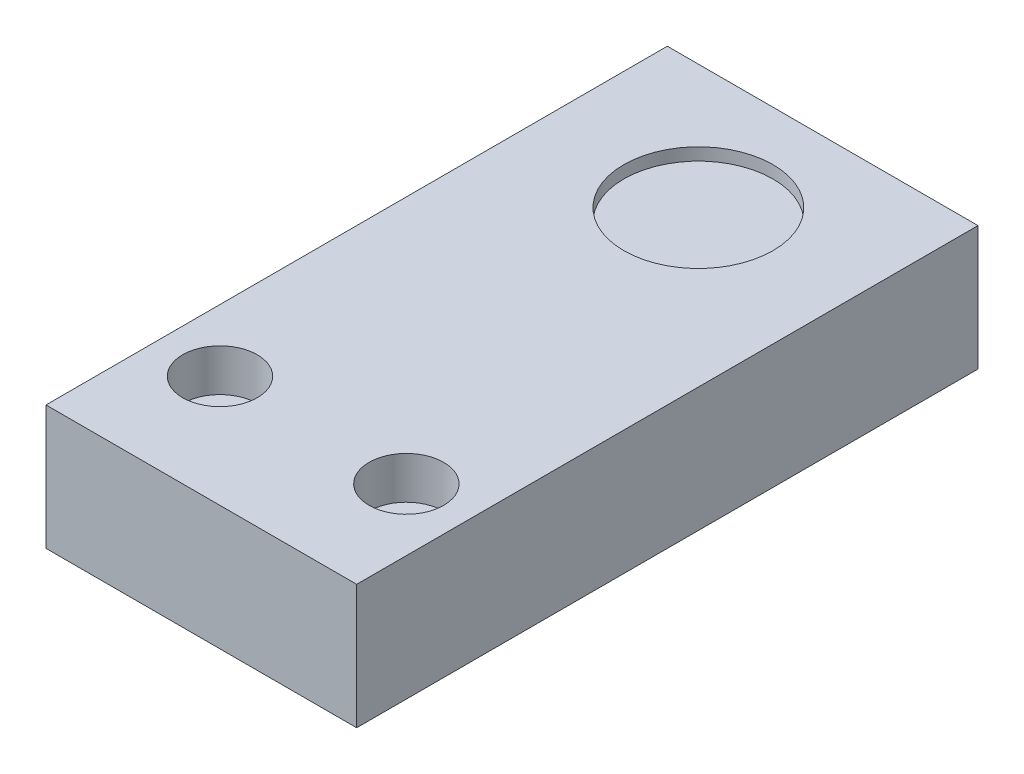
ISO-10303-21;
HEADER;
FILE_DESCRIPTION(('STEP AP214'),'2;1');
FILE_NAME('part.step','',(''),(''),'','','');
FILE_SCHEMA(('AUTOMOTIVE_DESIGN { 1 0 10303 214 1 1 1 1 }'));
ENDSEC;
DATA;
#1=APPLICATION_CONTEXT('core data for automotive mechanical design processes');
#2=APPLICATION_PROTOCOL_DEFINITION('international standard','automotive_design',2000,#1);
#3=PRODUCT_CONTEXT('',#1,'mechanical');
#4=PRODUCT('Part','Part','',(#3));
#5=PRODUCT_RELATED_PRODUCT_CATEGORY('part','',(#4));
#6=PRODUCT_DEFINITION_FORMATION('','',#4);
#7=PRODUCT_DEFINITION_CONTEXT('part definition',#1,'design');
#8=PRODUCT_DEFINITION('design','',#6,#7);
#9=PRODUCT_DEFINITION_SHAPE('','',#8);
#10=(LENGTH_UNIT() NAMED_UNIT(*) SI_UNIT(.MILLI.,.METRE.));
#11=(NAMED_UNIT(*) PLANE_ANGLE_UNIT() SI_UNIT($,.RADIAN.));
#12=(NAMED_UNIT(*) SI_UNIT($,.STERADIAN.) SOLID_ANGLE_UNIT());
#13=UNCERTAINTY_MEASURE_WITH_UNIT(LENGTH_MEASURE(1.E-05),#10,'distance_accuracy_value','');
#14=(GEOMETRIC_REPRESENTATION_CONTEXT(3) GLOBAL_UNCERTAINTY_ASSIGNED_CONTEXT((#13)) GLOBAL_UNIT_ASSIGNED_CONTEXT((#10,
#11,#12)) REPRESENTATION_CONTEXT('',''));
#15=CARTESIAN_POINT('',(0.,0.,0.));
#16=DIRECTION('',(0.,0.,1.));
#17=DIRECTION('',(1.,0.,0.));
#18=AXIS2_PLACEMENT_3D('',#15,#16,#17);
#19=CARTESIAN_POINT('',(12.5,10.,25.));
#20=DIRECTION('',(-1.,0.,0.));
#21=DIRECTION('',(0.,0.,1.));
#22=AXIS2_PLACEMENT_3D('',#19,#20,#21);
#23=PLANE('',#22);
#24=DIRECTION('',(0.,0.,-1.));
#25=VECTOR('',#24,1.);
#26=CARTESIAN_POINT('',(12.5,0.,25.));
#27=LINE('',#26,#25);
#28=CARTESIAN_POINT('',(12.5,0.,25.));
#29=VERTEX_POINT('',#28);
#30=CARTESIAN_POINT('',(12.5,0.,-25.));
#31=VERTEX_POINT('',#30);
#32=EDGE_CURVE('E98',#29,#31,#27,.T.);
#33=ORIENTED_EDGE('',*,*,#32,.T.);
#34=DIRECTION('',(0.,-1.,0.));
#35=VECTOR('',#34,1.);
#36=CARTESIAN_POINT('',(12.5,10.,-25.));
#37=LINE('',#36,#35);
#38=CARTESIAN_POINT('',(12.5,10.,-25.));
#39=VERTEX_POINT('',#38);
#40=EDGE_CURVE('E11',#39,#31,#37,.T.);
#41=ORIENTED_EDGE('',*,*,#40,.F.);
#42=DIRECTION('',(0.,0.,-1.));
#43=VECTOR('',#42,1.);
#44=CARTESIAN_POINT('',(12.5,10.,25.));
#45=LINE('',#44,#43);
#46=CARTESIAN_POINT('',(12.5,10.,25.));
#47=VERTEX_POINT('',#46);
#48=EDGE_CURVE('E86',#47,#39,#45,.T.);
#49=ORIENTED_EDGE('',*,*,#48,.F.);
#50=DIRECTION('',(0.,-1.,0.));
#51=VECTOR('',#50,1.);
#52=CARTESIAN_POINT('',(12.5,10.,25.));
#53=LINE('',#52,#51);
#54=EDGE_CURVE('E94',#47,#29,#53,.T.);
#55=ORIENTED_EDGE('',*,*,#54,.T.);
#56=EDGE_LOOP('',(#33,#41,#49,#55));
#57=FACE_BOUND('',#56,.T.);
#58=ADVANCED_FACE('F35',(#57),#23,.F.);
#59=CARTESIAN_POINT('',(-12.5,10.,-25.));
#60=DIRECTION('',(0.,0.,1.));
#61=DIRECTION('',(1.,0.,0.));
#62=AXIS2_PLACEMENT_3D('',#59,#60,#61);
#63=PLANE('',#62);
#64=DIRECTION('',(-1.,0.,0.));
#65=VECTOR('',#64,1.);
#66=CARTESIAN_POINT('',(-12.5,0.,-25.));
#67=LINE('',#66,#65);
#68=CARTESIAN_POINT('',(-12.5,0.,-25.));
#69=VERTEX_POINT('',#68);
#70=EDGE_CURVE('E90',#31,#69,#67,.T.);
#71=ORIENTED_EDGE('',*,*,#70,.T.);
#72=DIRECTION('',(0.,-1.,0.));
#73=VECTOR('',#72,1.);
#74=CARTESIAN_POINT('',(-12.5,10.,-25.));
#75=LINE('',#74,#73);
#76=CARTESIAN_POINT('',(-12.5,10.,-25.));
#77=VERTEX_POINT('',#76);
#78=EDGE_CURVE('E43',#77,#69,#75,.T.);
#79=ORIENTED_EDGE('',*,*,#78,.F.);
#80=DIRECTION('',(-1.,0.,0.));
#81=VECTOR('',#80,1.);
#82=CARTESIAN_POINT('',(-12.5,10.,-25.));
#83=LINE('',#82,#81);
#84=EDGE_CURVE('E81',#39,#77,#83,.T.);
#85=ORIENTED_EDGE('',*,*,#84,.F.);
#86=ORIENTED_EDGE('',*,*,#40,.T.);
#87=EDGE_LOOP('',(#71,#79,#85,#86));
#88=FACE_BOUND('',#87,.T.);
#89=ADVANCED_FACE('F89',(#88),#63,.F.);
#90=CARTESIAN_POINT('',(-12.5,10.,25.));
#91=DIRECTION('',(1.,0.,0.));
#92=DIRECTION('',(0.,0.,-1.));
#93=AXIS2_PLACEMENT_3D('',#90,#91,#92);
#94=PLANE('',#93);
#95=DIRECTION('',(0.,0.,1.));
#96=VECTOR('',#95,1.);
#97=CARTESIAN_POINT('',(-12.5,0.,25.));
#98=LINE('',#97,#96);
#99=CARTESIAN_POINT('',(-12.5,0.,25.));
#100=VERTEX_POINT('',#99);
#101=EDGE_CURVE('E68',#69,#100,#98,.T.);
#102=ORIENTED_EDGE('',*,*,#101,.T.);
#103=DIRECTION('',(0.,-1.,0.));
#104=VECTOR('',#103,1.);
#105=CARTESIAN_POINT('',(-12.5,10.,25.));
#106=LINE('',#105,#104);
#107=CARTESIAN_POINT('',(-12.5,10.,25.));
#108=VERTEX_POINT('',#107);
#109=EDGE_CURVE('E91',#108,#100,#106,.T.);
#110=ORIENTED_EDGE('',*,*,#109,.F.);
#111=DIRECTION('',(0.,0.,1.));
#112=VECTOR('',#111,1.);
#113=CARTESIAN_POINT('',(-12.5,10.,25.));
#114=LINE('',#113,#112);
#115=EDGE_CURVE('E84',#77,#108,#114,.T.);
#116=ORIENTED_EDGE('',*,*,#115,.F.);
#117=ORIENTED_EDGE('',*,*,#78,.T.);
#118=EDGE_LOOP('',(#102,#110,#116,#117));
#119=FACE_BOUND('',#118,.T.);
#120=ADVANCED_FACE('F92',(#119),#94,.F.);
#121=CARTESIAN_POINT('',(-12.5,10.,25.));
#122=DIRECTION('',(0.,0.,-1.));
#123=DIRECTION('',(-1.,0.,0.));
#124=AXIS2_PLACEMENT_3D('',#121,#122,#123);
#125=PLANE('',#124);
#126=DIRECTION('',(1.,0.,0.));
#127=VECTOR('',#126,1.);
#128=CARTESIAN_POINT('',(-12.5,0.,25.));
#129=LINE('',#128,#127);
#130=EDGE_CURVE('E74',#100,#29,#129,.T.);
#131=ORIENTED_EDGE('',*,*,#130,.T.);
#132=ORIENTED_EDGE('',*,*,#54,.F.);
#133=DIRECTION('',(1.,0.,0.));
#134=VECTOR('',#133,1.);
#135=CARTESIAN_POINT('',(-12.5,10.,25.));
#136=LINE('',#135,#134);
#137=EDGE_CURVE('E51',#108,#47,#136,.T.);
#138=ORIENTED_EDGE('',*,*,#137,.F.);
#139=ORIENTED_EDGE('',*,*,#109,.T.);
#140=EDGE_LOOP('',(#131,#132,#138,#139));
#141=FACE_BOUND('',#140,.T.);
#142=ADVANCED_FACE('F106',(#141),#125,.F.);
#143=CARTESIAN_POINT('',(0.,10.,0.));
#144=DIRECTION('',(0.,-1.,0.));
#145=DIRECTION('',(0.,0.,-1.));
#146=AXIS2_PLACEMENT_3D('',#143,#144,#145);
#147=PLANE('',#146);
#148=CARTESIAN_POINT('',(0.,10.,-15.));
#149=DIRECTION('',(0.,1.,0.));
#150=DIRECTION('',(0.,0.,1.));
#151=AXIS2_PLACEMENT_3D('',#148,#149,#150);
#152=CIRCLE('',#151,6.);
#153=CARTESIAN_POINT('',(0.,10.,-9.));
#154=VERTEX_POINT('',#153);
#155=EDGE_CURVE('E136',#154,#154,#152,.T.);
#156=ORIENTED_EDGE('',*,*,#155,.F.);
#157=EDGE_LOOP('',(#156));
#158=FACE_BOUND('',#157,.T.);
#159=CARTESIAN_POINT('',(-7.5,10.,16.));
#160=DIRECTION('',(0.,1.,0.));
#161=DIRECTION('',(0.,0.,1.));
#162=AXIS2_PLACEMENT_3D('',#159,#160,#161);
#163=CIRCLE('',#162,3.);
#164=CARTESIAN_POINT('',(-7.5,10.,19.));
#165=VERTEX_POINT('',#164);
#166=EDGE_CURVE('E132',#165,#165,#163,.T.);
#167=ORIENTED_EDGE('',*,*,#166,.F.);
#168=EDGE_LOOP('',(#167));
#169=FACE_BOUND('',#168,.T.);
#170=CARTESIAN_POINT('',(7.5,10.,16.));
#171=DIRECTION('',(0.,1.,0.));
#172=DIRECTION('',(0.,0.,1.));
#173=AXIS2_PLACEMENT_3D('',#170,#171,#172);
#174=CIRCLE('',#173,3.);
#175=CARTESIAN_POINT('',(7.5,10.,19.));
#176=VERTEX_POINT('',#175);
#177=EDGE_CURVE('E120',#176,#176,#174,.T.);
#178=ORIENTED_EDGE('',*,*,#177,.F.);
#179=EDGE_LOOP('',(#178));
#180=FACE_BOUND('',#179,.T.);
#181=ORIENTED_EDGE('',*,*,#48,.T.);
#182=ORIENTED_EDGE('',*,*,#84,.T.);
#183=ORIENTED_EDGE('',*,*,#115,.T.);
#184=ORIENTED_EDGE('',*,*,#137,.T.);
#185=EDGE_LOOP('',(#181,#182,#183,#184));
#186=FACE_BOUND('',#185,.T.);
#187=ADVANCED_FACE('F82',(#158,#169,#180,#186),#147,.F.);
#188=CARTESIAN_POINT('',(0.,0.,0.));
#189=DIRECTION('',(0.,-1.,0.));
#190=DIRECTION('',(0.,0.,-1.));
#191=AXIS2_PLACEMENT_3D('',#188,#189,#190);
#192=PLANE('',#191);
#193=CARTESIAN_POINT('',(-7.5,0.,16.));
#194=DIRECTION('',(0.,1.,0.));
#195=DIRECTION('',(0.,0.,1.));
#196=AXIS2_PLACEMENT_3D('',#193,#194,#195);
#197=CIRCLE('',#196,1.6);
#198=CARTESIAN_POINT('',(-7.5,0.,17.6));
#199=VERTEX_POINT('',#198);
#200=EDGE_CURVE('E123',#199,#199,#197,.T.);
#201=ORIENTED_EDGE('',*,*,#200,.T.);
#202=EDGE_LOOP('',(#201));
#203=FACE_BOUND('',#202,.T.);
#204=CARTESIAN_POINT('',(7.5,0.,16.));
#205=DIRECTION('',(0.,1.,0.));
#206=DIRECTION('',(0.,0.,1.));
#207=AXIS2_PLACEMENT_3D('',#204,#205,#206);
#208=CIRCLE('',#207,1.6);
#209=CARTESIAN_POINT('',(7.5,0.,17.6));
#210=VERTEX_POINT('',#209);
#211=EDGE_CURVE('E101',#210,#210,#208,.T.);
#212=ORIENTED_EDGE('',*,*,#211,.T.);
#213=EDGE_LOOP('',(#212));
#214=FACE_BOUND('',#213,.T.);
#215=ORIENTED_EDGE('',*,*,#32,.F.);
#216=ORIENTED_EDGE('',*,*,#130,.F.);
#217=ORIENTED_EDGE('',*,*,#101,.F.);
#218=ORIENTED_EDGE('',*,*,#70,.F.);
#219=EDGE_LOOP('',(#215,#216,#217,#218));
#220=FACE_BOUND('',#219,.T.);
#221=ADVANCED_FACE('F109',(#203,#214,#220),#192,.T.);
#222=CARTESIAN_POINT('',(7.5,10.,16.));
#223=DIRECTION('',(0.,1.,0.));
#224=DIRECTION('',(0.,0.,1.));
#225=AXIS2_PLACEMENT_3D('',#222,#223,#224);
#226=CYLINDRICAL_SURFACE('',#225,1.6);
#227=ORIENTED_EDGE('',*,*,#211,.F.);
#228=EDGE_LOOP('',(#227));
#229=FACE_BOUND('',#228,.T.);
#230=CARTESIAN_POINT('',(7.5,6.6,16.));
#231=DIRECTION('',(0.,1.,0.));
#232=DIRECTION('',(0.,0.,1.));
#233=AXIS2_PLACEMENT_3D('',#230,#231,#232);
#234=CIRCLE('',#233,1.6);
#235=CARTESIAN_POINT('',(7.5,6.6,17.6));
#236=VERTEX_POINT('',#235);
#237=EDGE_CURVE('E114',#236,#236,#234,.T.);
#238=ORIENTED_EDGE('',*,*,#237,.T.);
#239=EDGE_LOOP('',(#238));
#240=FACE_BOUND('',#239,.T.);
#241=ADVANCED_FACE('F171',(#229,#240),#226,.F.);
#242=CARTESIAN_POINT('',(9.1,6.6,16.));
#243=DIRECTION('',(0.,-1.,0.));
#244=DIRECTION('',(0.,0.,-1.));
#245=AXIS2_PLACEMENT_3D('',#242,#243,#244);
#246=PLANE('',#245);
#247=ORIENTED_EDGE('',*,*,#237,.F.);
#248=EDGE_LOOP('',(#247));
#249=FACE_BOUND('',#248,.T.);
#250=CARTESIAN_POINT('',(7.5,6.6,16.));
#251=DIRECTION('',(0.,1.,0.));
#252=DIRECTION('',(0.,0.,1.));
#253=AXIS2_PLACEMENT_3D('',#250,#251,#252);
#254=CIRCLE('',#253,3.);
#255=CARTESIAN_POINT('',(7.5,6.6,19.));
#256=VERTEX_POINT('',#255);
#257=EDGE_CURVE('E117',#256,#256,#254,.T.);
#258=ORIENTED_EDGE('',*,*,#257,.T.);
#259=EDGE_LOOP('',(#258));
#260=FACE_BOUND('',#259,.T.);
#261=ADVANCED_FACE('F161',(#249,#260),#246,.F.);
#262=CARTESIAN_POINT('',(7.5,10.,16.));
#263=DIRECTION('',(0.,1.,0.));
#264=DIRECTION('',(0.,0.,1.));
#265=AXIS2_PLACEMENT_3D('',#262,#263,#264);
#266=CYLINDRICAL_SURFACE('',#265,3.);
#267=ORIENTED_EDGE('',*,*,#257,.F.);
#268=EDGE_LOOP('',(#267));
#269=FACE_BOUND('',#268,.T.);
#270=ORIENTED_EDGE('',*,*,#177,.T.);
#271=EDGE_LOOP('',(#270));
#272=FACE_BOUND('',#271,.T.);
#273=ADVANCED_FACE('F158',(#269,#272),#266,.F.);
#274=CARTESIAN_POINT('',(-7.5,10.,16.));
#275=DIRECTION('',(0.,1.,0.));
#276=DIRECTION('',(0.,0.,1.));
#277=AXIS2_PLACEMENT_3D('',#274,#275,#276);
#278=CYLINDRICAL_SURFACE('',#277,1.6);
#279=ORIENTED_EDGE('',*,*,#200,.F.);
#280=EDGE_LOOP('',(#279));
#281=FACE_BOUND('',#280,.T.);
#282=CARTESIAN_POINT('',(-7.5,6.6,16.));
#283=DIRECTION('',(0.,1.,0.));
#284=DIRECTION('',(0.,0.,1.));
#285=AXIS2_PLACEMENT_3D('',#282,#283,#284);
#286=CIRCLE('',#285,1.6);
#287=CARTESIAN_POINT('',(-7.5,6.6,17.6));
#288=VERTEX_POINT('',#287);
#289=EDGE_CURVE('E126',#288,#288,#286,.T.);
#290=ORIENTED_EDGE('',*,*,#289,.T.);
#291=EDGE_LOOP('',(#290));
#292=FACE_BOUND('',#291,.T.);
#293=ADVANCED_FACE('F160',(#281,#292),#278,.F.);
#294=CARTESIAN_POINT('',(-5.9,6.6,16.));
#295=DIRECTION('',(0.,-1.,0.));
#296=DIRECTION('',(0.,0.,-1.));
#297=AXIS2_PLACEMENT_3D('',#294,#295,#296);
#298=PLANE('',#297);
#299=ORIENTED_EDGE('',*,*,#289,.F.);
#300=EDGE_LOOP('',(#299));
#301=FACE_BOUND('',#300,.T.);
#302=CARTESIAN_POINT('',(-7.5,6.6,16.));
#303=DIRECTION('',(0.,1.,0.));
#304=DIRECTION('',(0.,0.,1.));
#305=AXIS2_PLACEMENT_3D('',#302,#303,#304);
#306=CIRCLE('',#305,3.);
#307=CARTESIAN_POINT('',(-7.5,6.6,19.));
#308=VERTEX_POINT('',#307);
#309=EDGE_CURVE('E129',#308,#308,#306,.T.);
#310=ORIENTED_EDGE('',*,*,#309,.T.);
#311=EDGE_LOOP('',(#310));
#312=FACE_BOUND('',#311,.T.);
#313=ADVANCED_FACE('F168',(#301,#312),#298,.F.);
#314=CARTESIAN_POINT('',(-7.5,10.,16.));
#315=DIRECTION('',(0.,1.,0.));
#316=DIRECTION('',(0.,0.,1.));
#317=AXIS2_PLACEMENT_3D('',#314,#315,#316);
#318=CYLINDRICAL_SURFACE('',#317,3.);
#319=ORIENTED_EDGE('',*,*,#309,.F.);
#320=EDGE_LOOP('',(#319));
#321=FACE_BOUND('',#320,.T.);
#322=ORIENTED_EDGE('',*,*,#166,.T.);
#323=EDGE_LOOP('',(#322));
#324=FACE_BOUND('',#323,.T.);
#325=ADVANCED_FACE('F147',(#321,#324),#318,.F.);
#326=CARTESIAN_POINT('',(0.,9.,-15.));
#327=DIRECTION('',(0.,1.,0.));
#328=DIRECTION('',(0.,0.,1.));
#329=AXIS2_PLACEMENT_3D('',#326,#327,#328);
#330=CYLINDRICAL_SURFACE('',#329,6.);
#331=CARTESIAN_POINT('',(0.,9.,-15.));
#332=DIRECTION('',(0.,1.,0.));
#333=DIRECTION('',(0.,0.,1.));
#334=AXIS2_PLACEMENT_3D('',#331,#332,#333);
#335=CIRCLE('',#334,6.);
#336=CARTESIAN_POINT('',(0.,9.,-9.));
#337=VERTEX_POINT('',#336);
#338=EDGE_CURVE('E135',#337,#337,#335,.T.);
#339=ORIENTED_EDGE('',*,*,#338,.F.);
#340=EDGE_LOOP('',(#339));
#341=FACE_BOUND('',#340,.T.);
#342=ORIENTED_EDGE('',*,*,#155,.T.);
#343=EDGE_LOOP('',(#342));
#344=FACE_BOUND('',#343,.T.);
#345=ADVANCED_FACE('F144',(#341,#344),#330,.F.);
#346=CARTESIAN_POINT('',(0.,9.,-15.));
#347=DIRECTION('',(0.,1.,0.));
#348=DIRECTION('',(0.,0.,1.));
#349=AXIS2_PLACEMENT_3D('',#346,#347,#348);
#350=PLANE('',#349);
#351=ORIENTED_EDGE('',*,*,#338,.T.);
#352=EDGE_LOOP('',(#351));
#353=FACE_BOUND('',#352,.T.);
#354=ADVANCED_FACE('F142',(#353),#350,.T.);
#355=CLOSED_SHELL('',(#58,#89,#120,#142,#187,#221,#241,#261,#273,#293,#313,#325,#345,#354));
#356=MANIFOLD_SOLID_BREP('B2',#355);
#357=ADVANCED_BREP_SHAPE_REPRESENTATION('',(#18,#356),#14);
#358=SHAPE_DEFINITION_REPRESENTATION(#9,#357);
ENDSEC;
END-ISO-10303-21;
